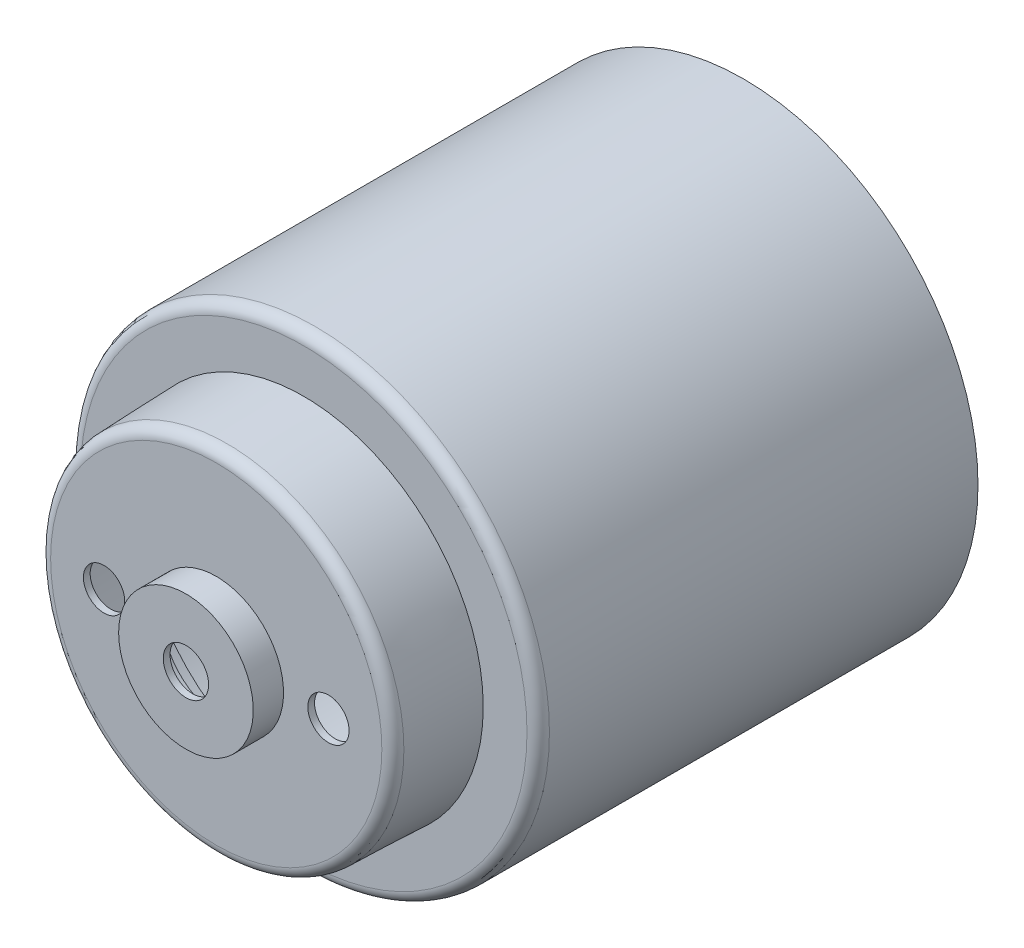
ISO-10303-21;
HEADER;
FILE_DESCRIPTION(('STEP AP214'),'2;1');
FILE_NAME('part.step','',(''),(''),'','','');
FILE_SCHEMA(('AUTOMOTIVE_DESIGN { 1 0 10303 214 1 1 1 1 }'));
ENDSEC;
DATA;
#1=APPLICATION_CONTEXT('core data for automotive mechanical design processes');
#2=APPLICATION_PROTOCOL_DEFINITION('international standard','automotive_design',2000,#1);
#3=PRODUCT_CONTEXT('',#1,'mechanical');
#4=PRODUCT('Part','Part','',(#3));
#5=PRODUCT_RELATED_PRODUCT_CATEGORY('part','',(#4));
#6=PRODUCT_DEFINITION_FORMATION('','',#4);
#7=PRODUCT_DEFINITION_CONTEXT('part definition',#1,'design');
#8=PRODUCT_DEFINITION('design','',#6,#7);
#9=PRODUCT_DEFINITION_SHAPE('','',#8);
#10=(LENGTH_UNIT() NAMED_UNIT(*) SI_UNIT(.MILLI.,.METRE.));
#11=(NAMED_UNIT(*) PLANE_ANGLE_UNIT() SI_UNIT($,.RADIAN.));
#12=(NAMED_UNIT(*) SI_UNIT($,.STERADIAN.) SOLID_ANGLE_UNIT());
#13=UNCERTAINTY_MEASURE_WITH_UNIT(LENGTH_MEASURE(1.E-05),#10,'distance_accuracy_value','');
#14=(GEOMETRIC_REPRESENTATION_CONTEXT(3) GLOBAL_UNCERTAINTY_ASSIGNED_CONTEXT((#13)) GLOBAL_UNIT_ASSIGNED_CONTEXT((#10,
#11,#12)) REPRESENTATION_CONTEXT('',''));
#15=CARTESIAN_POINT('',(0.,0.,0.));
#16=DIRECTION('',(0.,0.,1.));
#17=DIRECTION('',(1.,0.,0.));
#18=AXIS2_PLACEMENT_3D('',#15,#16,#17);
#19=CARTESIAN_POINT('',(0.,0.,23.5));
#20=DIRECTION('',(0.,0.,1.));
#21=DIRECTION('',(1.,0.,0.));
#22=AXIS2_PLACEMENT_3D('',#19,#20,#21);
#23=PLANE('',#22);
#24=CARTESIAN_POINT('',(5.,0.,23.5));
#25=DIRECTION('',(0.,0.,1.));
#26=DIRECTION('',(1.,0.,0.));
#27=AXIS2_PLACEMENT_3D('',#24,#25,#26);
#28=CIRCLE('',#27,0.92);
#29=CARTESIAN_POINT('',(5.92000000000001,0.,23.5));
#30=VERTEX_POINT('',#29);
#31=EDGE_CURVE('E56',#30,#30,#28,.T.);
#32=ORIENTED_EDGE('',*,*,#31,.F.);
#33=EDGE_LOOP('',(#32));
#34=FACE_BOUND('',#33,.T.);
#35=CARTESIAN_POINT('',(-5.,0.,23.5));
#36=DIRECTION('',(0.,0.,1.));
#37=DIRECTION('',(1.,0.,0.));
#38=AXIS2_PLACEMENT_3D('',#35,#36,#37);
#39=CIRCLE('',#38,0.92);
#40=CARTESIAN_POINT('',(-4.08,0.,23.5));
#41=VERTEX_POINT('',#40);
#42=EDGE_CURVE('E55',#41,#41,#39,.T.);
#43=ORIENTED_EDGE('',*,*,#42,.F.);
#44=EDGE_LOOP('',(#43));
#45=FACE_BOUND('',#44,.T.);
#46=CARTESIAN_POINT('',(0.,0.,23.5));
#47=DIRECTION('',(0.,0.,1.));
#48=DIRECTION('',(1.,0.,0.));
#49=AXIS2_PLACEMENT_3D('',#46,#47,#48);
#50=CIRCLE('',#49,7.38096461157865);
#51=CARTESIAN_POINT('',(7.38096461157865,0.,23.5));
#52=VERTEX_POINT('',#51);
#53=EDGE_CURVE('E104',#52,#52,#50,.T.);
#54=ORIENTED_EDGE('',*,*,#53,.T.);
#55=EDGE_LOOP('',(#54));
#56=FACE_BOUND('',#55,.T.);
#57=CARTESIAN_POINT('',(0.,0.,23.5));
#58=DIRECTION('',(0.,0.,1.));
#59=DIRECTION('',(1.,0.,0.));
#60=AXIS2_PLACEMENT_3D('',#57,#58,#59);
#61=CIRCLE('',#60,3.);
#62=CARTESIAN_POINT('',(-3.,0.,23.5));
#63=VERTEX_POINT('',#62);
#64=EDGE_CURVE('E90',#63,#63,#61,.T.);
#65=ORIENTED_EDGE('',*,*,#64,.F.);
#66=EDGE_LOOP('',(#65));
#67=FACE_BOUND('',#66,.T.);
#68=ADVANCED_FACE('F32',(#34,#45,#56,#67),#23,.T.);
#69=CARTESIAN_POINT('',(0.,0.,19.6));
#70=DIRECTION('',(0.,0.,1.));
#71=DIRECTION('',(1.,0.,0.));
#72=AXIS2_PLACEMENT_3D('',#69,#70,#71);
#73=PLANE('',#72);
#74=CARTESIAN_POINT('',(0.,0.,19.6));
#75=DIRECTION('',(0.,0.,1.));
#76=DIRECTION('',(1.,0.,0.));
#77=AXIS2_PLACEMENT_3D('',#74,#75,#76);
#78=CIRCLE('',#77,9.95);
#79=CARTESIAN_POINT('',(9.95,0.,19.6));
#80=VERTEX_POINT('',#79);
#81=EDGE_CURVE('E40',#80,#80,#78,.T.);
#82=ORIENTED_EDGE('',*,*,#81,.T.);
#83=EDGE_LOOP('',(#82));
#84=FACE_BOUND('',#83,.T.);
#85=CARTESIAN_POINT('',(0.,0.,19.6));
#86=DIRECTION('',(0.,0.,1.));
#87=DIRECTION('',(1.,0.,0.));
#88=AXIS2_PLACEMENT_3D('',#85,#86,#87);
#89=CIRCLE('',#88,8.);
#90=CARTESIAN_POINT('',(8.,0.,19.6));
#91=VERTEX_POINT('',#90);
#92=EDGE_CURVE('E98',#91,#91,#89,.T.);
#93=ORIENTED_EDGE('',*,*,#92,.F.);
#94=EDGE_LOOP('',(#93));
#95=FACE_BOUND('',#94,.T.);
#96=ADVANCED_FACE('F121',(#84,#95),#73,.T.);
#97=CARTESIAN_POINT('',(0.,0.,19.6));
#98=DIRECTION('',(0.,0.,-1.));
#99=DIRECTION('',(-1.,0.,0.));
#100=AXIS2_PLACEMENT_3D('',#97,#98,#99);
#101=CYLINDRICAL_SURFACE('',#100,10.45);
#102=CARTESIAN_POINT('',(0.,0.,19.1));
#103=DIRECTION('',(0.,0.,1.));
#104=DIRECTION('',(1.,0.,0.));
#105=AXIS2_PLACEMENT_3D('',#102,#103,#104);
#106=CIRCLE('',#105,10.45);
#107=CARTESIAN_POINT('',(10.45,0.,19.1));
#108=VERTEX_POINT('',#107);
#109=EDGE_CURVE('E10',#108,#108,#106,.F.);
#110=ORIENTED_EDGE('',*,*,#109,.T.);
#111=EDGE_LOOP('',(#110));
#112=FACE_BOUND('',#111,.T.);
#113=CARTESIAN_POINT('',(0.,0.,0.));
#114=DIRECTION('',(0.,0.,1.));
#115=DIRECTION('',(1.,0.,0.));
#116=AXIS2_PLACEMENT_3D('',#113,#114,#115);
#117=CIRCLE('',#116,10.45);
#118=CARTESIAN_POINT('',(10.45,0.,0.));
#119=VERTEX_POINT('',#118);
#120=EDGE_CURVE('E101',#119,#119,#117,.T.);
#121=ORIENTED_EDGE('',*,*,#120,.T.);
#122=EDGE_LOOP('',(#121));
#123=FACE_BOUND('',#122,.T.);
#124=ADVANCED_FACE('F141',(#112,#123),#101,.T.);
#125=CARTESIAN_POINT('',(0.,0.,0.));
#126=DIRECTION('',(0.,0.,1.));
#127=DIRECTION('',(1.,0.,0.));
#128=AXIS2_PLACEMENT_3D('',#125,#126,#127);
#129=PLANE('',#128);
#130=CARTESIAN_POINT('',(0.,0.,0.));
#131=DIRECTION('',(0.,0.,1.));
#132=DIRECTION('',(1.,0.,0.));
#133=AXIS2_PLACEMENT_3D('',#130,#131,#132);
#134=CIRCLE('',#133,10.15);
#135=CARTESIAN_POINT('',(10.15,0.,0.));
#136=VERTEX_POINT('',#135);
#137=EDGE_CURVE('E73',#136,#136,#134,.T.);
#138=ORIENTED_EDGE('',*,*,#137,.T.);
#139=EDGE_LOOP('',(#138));
#140=FACE_BOUND('',#139,.T.);
#141=ORIENTED_EDGE('',*,*,#120,.F.);
#142=EDGE_LOOP('',(#141));
#143=FACE_BOUND('',#142,.T.);
#144=ADVANCED_FACE('F136',(#140,#143),#129,.F.);
#145=CARTESIAN_POINT('',(0.,0.,19.6));
#146=DIRECTION('',(0.,0.,-1.));
#147=DIRECTION('',(1.,0.,0.));
#148=AXIS2_PLACEMENT_3D('',#145,#146,#147);
#149=CONICAL_SURFACE('',#148,8.,0.0349065850398867);
#150=CARTESIAN_POINT('',(0.,0.,23.0174497483512));
#151=DIRECTION('',(0.,0.,-1.));
#152=DIRECTION('',(-1.,0.,0.));
#153=AXIS2_PLACEMENT_3D('',#150,#151,#152);
#154=CIRCLE('',#153,7.8806600250882);
#155=CARTESIAN_POINT('',(-7.88066002508819,0.,23.0174497483512));
#156=VERTEX_POINT('',#155);
#157=EDGE_CURVE('E45',#156,#156,#154,.T.);
#158=ORIENTED_EDGE('',*,*,#157,.T.);
#159=EDGE_LOOP('',(#158));
#160=FACE_BOUND('',#159,.T.);
#161=ORIENTED_EDGE('',*,*,#92,.T.);
#162=EDGE_LOOP('',(#161));
#163=FACE_BOUND('',#162,.T.);
#164=ADVANCED_FACE('F34',(#160,#163),#149,.T.);
#165=CARTESIAN_POINT('',(0.,0.,24.85));
#166=DIRECTION('',(0.,0.,-1.));
#167=DIRECTION('',(-1.,0.,0.));
#168=AXIS2_PLACEMENT_3D('',#165,#166,#167);
#169=CYLINDRICAL_SURFACE('',#168,3.);
#170=CARTESIAN_POINT('',(0.,0.,24.85));
#171=DIRECTION('',(0.,0.,1.));
#172=DIRECTION('',(1.,0.,0.));
#173=AXIS2_PLACEMENT_3D('',#170,#171,#172);
#174=CIRCLE('',#173,3.);
#175=CARTESIAN_POINT('',(-3.,0.,24.85));
#176=VERTEX_POINT('',#175);
#177=EDGE_CURVE('E95',#176,#176,#174,.T.);
#178=CARTESIAN_POINT('',(-3.,0.,24.85));
#179=CARTESIAN_POINT('',(-3.,0.,24.8359375));
#180=CARTESIAN_POINT('',(-3.,0.,24.821875));
#181=CARTESIAN_POINT('',(-3.,0.,24.79375));
#182=CARTESIAN_POINT('',(-3.,0.,24.7796875));
#183=CARTESIAN_POINT('',(-3.,0.,24.7515625));
#184=CARTESIAN_POINT('',(-3.,0.,24.7375));
#185=CARTESIAN_POINT('',(-3.,0.,24.709375));
#186=CARTESIAN_POINT('',(-3.,0.,24.6953125));
#187=CARTESIAN_POINT('',(-3.,0.,24.6671875));
#188=CARTESIAN_POINT('',(-3.,0.,24.653125));
#189=CARTESIAN_POINT('',(-3.,0.,24.625));
#190=CARTESIAN_POINT('',(-3.,0.,24.6109375));
#191=CARTESIAN_POINT('',(-3.,0.,24.5828125));
#192=CARTESIAN_POINT('',(-3.,0.,24.56875));
#193=CARTESIAN_POINT('',(-3.,0.,24.540625));
#194=CARTESIAN_POINT('',(-3.,0.,24.5265625));
#195=CARTESIAN_POINT('',(-3.,0.,24.4984375));
#196=CARTESIAN_POINT('',(-3.,0.,24.484375));
#197=CARTESIAN_POINT('',(-3.,0.,24.45625));
#198=CARTESIAN_POINT('',(-3.,0.,24.4421875));
#199=CARTESIAN_POINT('',(-3.,0.,24.4140625));
#200=CARTESIAN_POINT('',(-3.,0.,24.4));
#201=CARTESIAN_POINT('',(-3.,0.,24.371875));
#202=CARTESIAN_POINT('',(-3.,0.,24.3578125));
#203=CARTESIAN_POINT('',(-3.,0.,24.3296875));
#204=CARTESIAN_POINT('',(-3.,0.,24.315625));
#205=CARTESIAN_POINT('',(-3.,0.,24.2875));
#206=CARTESIAN_POINT('',(-3.,0.,24.2734375));
#207=CARTESIAN_POINT('',(-3.,0.,24.2453125));
#208=CARTESIAN_POINT('',(-3.,0.,24.23125));
#209=CARTESIAN_POINT('',(-3.,0.,24.203125));
#210=CARTESIAN_POINT('',(-3.,0.,24.1890625));
#211=CARTESIAN_POINT('',(-3.,0.,24.1609375));
#212=CARTESIAN_POINT('',(-3.,0.,24.146875));
#213=CARTESIAN_POINT('',(-3.,0.,24.11875));
#214=CARTESIAN_POINT('',(-3.,0.,24.1046875));
#215=CARTESIAN_POINT('',(-3.,0.,24.0765625));
#216=CARTESIAN_POINT('',(-3.,0.,24.0625));
#217=CARTESIAN_POINT('',(-3.,0.,24.034375));
#218=CARTESIAN_POINT('',(-3.,0.,24.0203125));
#219=CARTESIAN_POINT('',(-3.,0.,23.9921875));
#220=CARTESIAN_POINT('',(-3.,0.,23.978125));
#221=CARTESIAN_POINT('',(-3.,0.,23.95));
#222=CARTESIAN_POINT('',(-3.,0.,23.9359375));
#223=CARTESIAN_POINT('',(-3.,0.,23.9078125));
#224=CARTESIAN_POINT('',(-3.,0.,23.89375));
#225=CARTESIAN_POINT('',(-3.,0.,23.865625));
#226=CARTESIAN_POINT('',(-3.,0.,23.8515625));
#227=CARTESIAN_POINT('',(-3.,0.,23.8234375));
#228=CARTESIAN_POINT('',(-3.,0.,23.809375));
#229=CARTESIAN_POINT('',(-3.,0.,23.78125));
#230=CARTESIAN_POINT('',(-3.,0.,23.7671875));
#231=CARTESIAN_POINT('',(-3.,0.,23.7390625));
#232=CARTESIAN_POINT('',(-3.,0.,23.725));
#233=CARTESIAN_POINT('',(-3.,0.,23.696875));
#234=CARTESIAN_POINT('',(-3.,0.,23.6828125));
#235=CARTESIAN_POINT('',(-3.,0.,23.6546875));
#236=CARTESIAN_POINT('',(-3.,0.,23.640625));
#237=CARTESIAN_POINT('',(-3.,0.,23.6125));
#238=CARTESIAN_POINT('',(-3.,0.,23.5984375));
#239=CARTESIAN_POINT('',(-3.,0.,23.5703125));
#240=CARTESIAN_POINT('',(-3.,0.,23.55625));
#241=CARTESIAN_POINT('',(-3.,0.,23.528125));
#242=CARTESIAN_POINT('',(-3.,0.,23.5140625));
#243=CARTESIAN_POINT('',(-3.,0.,23.5));
#244=B_SPLINE_CURVE_WITH_KNOTS('',3,(#178,#179,#180,#181,#182,#183,#184,#185,#186,#187,#188,
#189,#190,#191,#192,#193,#194,#195,#196,#197,#198,#199,#200,#201,#202,#203,#204,#205,#206,#207,
#208,#209,#210,#211,#212,#213,#214,#215,#216,#217,#218,#219,#220,#221,#222,#223,#224,#225,#226,
#227,#228,#229,#230,#231,#232,#233,#234,#235,#236,#237,#238,#239,#240,#241,#242,#243),
.UNSPECIFIED.,.F.,.F.,(4,2,2,2,2,2,2,2,2,2,2,2,2,2,2,2,2,2,2,2,2,2,2,2,2,2,2,2,2,2,2,2,4),(0.,
0.0421875000000023,0.0843750000000011,0.1265625,0.168750000000002,0.210937500000001,0.253125,
0.295312500000002,0.337500000000001,0.3796875,0.421875000000002,0.464062500000001,0.50625,
0.548437500000002,0.590625000000001,0.6328125,0.674999999999998,0.717187500000001,0.759375,
0.801562499999998,0.843750000000001,0.8859375,0.928124999999998,0.970312500000001,1.0125,
1.0546875,1.096875,1.1390625,1.18125,1.2234375,1.265625,1.3078125,1.35),.UNSPECIFIED.);
#245=EDGE_CURVE('BSEAM126',#176,#63,#244,.T.);
#246=ORIENTED_EDGE('',*,*,#177,.F.);
#247=ORIENTED_EDGE('',*,*,#64,.T.);
#248=ORIENTED_EDGE('',*,*,#245,.T.);
#249=ORIENTED_EDGE('',*,*,#245,.F.);
#250=EDGE_LOOP('',(#246,#248,#247,#249));
#251=FACE_BOUND('',#250,.T.);
#252=ADVANCED_FACE('F126',(#251),#169,.T.);
#253=CARTESIAN_POINT('',(0.,0.,24.85));
#254=DIRECTION('',(0.,0.,1.));
#255=DIRECTION('',(1.,0.,0.));
#256=AXIS2_PLACEMENT_3D('',#253,#254,#255);
#257=PLANE('',#256);
#258=CARTESIAN_POINT('',(0.,0.,24.85));
#259=DIRECTION('',(0.,0.,1.));
#260=DIRECTION('',(1.,0.,0.));
#261=AXIS2_PLACEMENT_3D('',#258,#259,#260);
#262=CIRCLE('',#261,1.01);
#263=CARTESIAN_POINT('',(1.01,0.,24.85));
#264=VERTEX_POINT('',#263);
#265=EDGE_CURVE('E52',#264,#264,#262,.T.);
#266=ORIENTED_EDGE('',*,*,#265,.F.);
#267=EDGE_LOOP('',(#266));
#268=FACE_BOUND('',#267,.T.);
#269=ORIENTED_EDGE('',*,*,#177,.T.);
#270=EDGE_LOOP('',(#269));
#271=FACE_BOUND('',#270,.T.);
#272=ADVANCED_FACE('F115',(#268,#271),#257,.T.);
#273=CARTESIAN_POINT('',(0.,0.,23.));
#274=DIRECTION('',(0.,0.,1.));
#275=DIRECTION('',(1.,0.,0.));
#276=AXIS2_PLACEMENT_3D('',#273,#274,#275);
#277=TOROIDAL_SURFACE('',#276,7.38096461157865,0.5);
#278=ORIENTED_EDGE('',*,*,#157,.F.);
#279=EDGE_LOOP('',(#278));
#280=FACE_BOUND('',#279,.T.);
#281=ORIENTED_EDGE('',*,*,#53,.F.);
#282=EDGE_LOOP('',(#281));
#283=FACE_BOUND('',#282,.T.);
#284=ADVANCED_FACE('F111',(#280,#283),#277,.T.);
#285=CARTESIAN_POINT('',(0.,0.,19.1));
#286=DIRECTION('',(0.,0.,1.));
#287=DIRECTION('',(1.,0.,0.));
#288=AXIS2_PLACEMENT_3D('',#285,#286,#287);
#289=TOROIDAL_SURFACE('',#288,9.95,0.5);
#290=ORIENTED_EDGE('',*,*,#109,.F.);
#291=EDGE_LOOP('',(#290));
#292=FACE_BOUND('',#291,.T.);
#293=ORIENTED_EDGE('',*,*,#81,.F.);
#294=EDGE_LOOP('',(#293));
#295=FACE_BOUND('',#294,.T.);
#296=ADVANCED_FACE('F114',(#292,#295),#289,.T.);
#297=CARTESIAN_POINT('',(0.,0.,23.2));
#298=DIRECTION('',(0.,0.,1.));
#299=DIRECTION('',(1.,0.,0.));
#300=AXIS2_PLACEMENT_3D('',#297,#298,#299);
#301=PLANE('',#300);
#302=CARTESIAN_POINT('',(5.,0.,23.2));
#303=DIRECTION('',(0.,0.,1.));
#304=DIRECTION('',(1.,0.,0.));
#305=AXIS2_PLACEMENT_3D('',#302,#303,#304);
#306=CIRCLE('',#305,0.92);
#307=CARTESIAN_POINT('',(5.92000000000001,0.,23.2));
#308=VERTEX_POINT('',#307);
#309=EDGE_CURVE('E36',#308,#308,#306,.T.);
#310=ORIENTED_EDGE('',*,*,#309,.T.);
#311=EDGE_LOOP('',(#310));
#312=FACE_BOUND('',#311,.T.);
#313=CARTESIAN_POINT('',(-5.,0.,23.2));
#314=DIRECTION('',(0.,0.,1.));
#315=DIRECTION('',(1.,0.,0.));
#316=AXIS2_PLACEMENT_3D('',#313,#314,#315);
#317=CIRCLE('',#316,0.92);
#318=CARTESIAN_POINT('',(-4.08,0.,23.2));
#319=VERTEX_POINT('',#318);
#320=EDGE_CURVE('E53',#319,#319,#317,.T.);
#321=ORIENTED_EDGE('',*,*,#320,.T.);
#322=EDGE_LOOP('',(#321));
#323=FACE_BOUND('',#322,.T.);
#324=CARTESIAN_POINT('',(0.,0.,23.2));
#325=DIRECTION('',(0.,0.,1.));
#326=DIRECTION('',(1.,0.,0.));
#327=AXIS2_PLACEMENT_3D('',#324,#325,#326);
#328=CIRCLE('',#327,7.38096461157865);
#329=CARTESIAN_POINT('',(7.38096461157865,0.,23.2));
#330=VERTEX_POINT('',#329);
#331=EDGE_CURVE('E69',#330,#330,#328,.T.);
#332=ORIENTED_EDGE('',*,*,#331,.F.);
#333=EDGE_LOOP('',(#332));
#334=FACE_BOUND('',#333,.T.);
#335=CARTESIAN_POINT('',(0.,0.,23.2));
#336=DIRECTION('',(0.,0.,1.));
#337=DIRECTION('',(1.,0.,0.));
#338=AXIS2_PLACEMENT_3D('',#335,#336,#337);
#339=CIRCLE('',#338,2.7);
#340=CARTESIAN_POINT('',(-2.7,0.,23.2));
#341=VERTEX_POINT('',#340);
#342=EDGE_CURVE('E51',#341,#341,#339,.T.);
#343=ORIENTED_EDGE('',*,*,#342,.T.);
#344=EDGE_LOOP('',(#343));
#345=FACE_BOUND('',#344,.T.);
#346=ADVANCED_FACE('F184',(#312,#323,#334,#345),#301,.F.);
#347=CARTESIAN_POINT('',(0.,0.,19.3));
#348=DIRECTION('',(0.,0.,1.));
#349=DIRECTION('',(1.,0.,0.));
#350=AXIS2_PLACEMENT_3D('',#347,#348,#349);
#351=PLANE('',#350);
#352=CARTESIAN_POINT('',(0.,0.,19.3));
#353=DIRECTION('',(0.,0.,1.));
#354=DIRECTION('',(1.,0.,0.));
#355=AXIS2_PLACEMENT_3D('',#352,#353,#354);
#356=CIRCLE('',#355,9.95);
#357=CARTESIAN_POINT('',(9.95,0.,19.3));
#358=VERTEX_POINT('',#357);
#359=EDGE_CURVE('E82',#358,#358,#356,.T.);
#360=ORIENTED_EDGE('',*,*,#359,.F.);
#361=EDGE_LOOP('',(#360));
#362=FACE_BOUND('',#361,.T.);
#363=CARTESIAN_POINT('',(0.,0.,19.3));
#364=DIRECTION('',(0.,0.,1.));
#365=DIRECTION('',(1.,0.,0.));
#366=AXIS2_PLACEMENT_3D('',#363,#364,#365);
#367=CIRCLE('',#366,7.71029336755788);
#368=CARTESIAN_POINT('',(7.71029336755788,0.,19.3));
#369=VERTEX_POINT('',#368);
#370=EDGE_CURVE('E79',#369,#369,#367,.T.);
#371=ORIENTED_EDGE('',*,*,#370,.T.);
#372=EDGE_LOOP('',(#371));
#373=FACE_BOUND('',#372,.T.);
#374=ADVANCED_FACE('F192',(#362,#373),#351,.F.);
#375=CARTESIAN_POINT('',(0.,0.,19.6));
#376=DIRECTION('',(0.,0.,-1.));
#377=DIRECTION('',(-1.,0.,0.));
#378=AXIS2_PLACEMENT_3D('',#375,#376,#377);
#379=CYLINDRICAL_SURFACE('',#378,10.15);
#380=CARTESIAN_POINT('',(0.,0.,19.1));
#381=DIRECTION('',(0.,0.,-1.));
#382=DIRECTION('',(-1.,0.,0.));
#383=AXIS2_PLACEMENT_3D('',#380,#381,#382);
#384=CIRCLE('',#383,10.15);
#385=CARTESIAN_POINT('',(-10.15,0.,19.1));
#386=VERTEX_POINT('',#385);
#387=EDGE_CURVE('E87',#386,#386,#384,.T.);
#388=ORIENTED_EDGE('',*,*,#387,.F.);
#389=EDGE_LOOP('',(#388));
#390=FACE_BOUND('',#389,.T.);
#391=ORIENTED_EDGE('',*,*,#137,.F.);
#392=EDGE_LOOP('',(#391));
#393=FACE_BOUND('',#392,.T.);
#394=ADVANCED_FACE('F200',(#390,#393),#379,.F.);
#395=CARTESIAN_POINT('',(0.,0.,19.5895301509893));
#396=DIRECTION('',(0.,0.,-1.));
#397=DIRECTION('',(1.,0.,0.));
#398=AXIS2_PLACEMENT_3D('',#395,#396,#397);
#399=CONICAL_SURFACE('',#398,7.70018275189427,0.0349065850398867);
#400=CARTESIAN_POINT('',(0.,0.,23.0069798993405));
#401=DIRECTION('',(0.,0.,-1.));
#402=DIRECTION('',(-1.,0.,0.));
#403=AXIS2_PLACEMENT_3D('',#400,#401,#402);
#404=CIRCLE('',#403,7.58084277698247);
#405=CARTESIAN_POINT('',(-7.58084277698247,0.,23.0069798993405));
#406=VERTEX_POINT('',#405);
#407=EDGE_CURVE('E72',#406,#406,#404,.T.);
#408=ORIENTED_EDGE('',*,*,#407,.F.);
#409=EDGE_LOOP('',(#408));
#410=FACE_BOUND('',#409,.T.);
#411=ORIENTED_EDGE('',*,*,#370,.F.);
#412=EDGE_LOOP('',(#411));
#413=FACE_BOUND('',#412,.T.);
#414=ADVANCED_FACE('F208',(#410,#413),#399,.F.);
#415=CARTESIAN_POINT('',(0.,0.,24.85));
#416=DIRECTION('',(0.,0.,-1.));
#417=DIRECTION('',(-1.,0.,0.));
#418=AXIS2_PLACEMENT_3D('',#415,#416,#417);
#419=CYLINDRICAL_SURFACE('',#418,2.7);
#420=CARTESIAN_POINT('',(0.,0.,24.55));
#421=DIRECTION('',(0.,0.,1.));
#422=DIRECTION('',(1.,0.,0.));
#423=AXIS2_PLACEMENT_3D('',#420,#421,#422);
#424=CIRCLE('',#423,2.7);
#425=CARTESIAN_POINT('',(-2.7,0.,24.55));
#426=VERTEX_POINT('',#425);
#427=EDGE_CURVE('E76',#426,#426,#424,.T.);
#428=CARTESIAN_POINT('',(-2.7,0.,24.55));
#429=CARTESIAN_POINT('',(-2.7,0.,24.5359375));
#430=CARTESIAN_POINT('',(-2.7,0.,24.521875));
#431=CARTESIAN_POINT('',(-2.7,0.,24.49375));
#432=CARTESIAN_POINT('',(-2.7,0.,24.4796875));
#433=CARTESIAN_POINT('',(-2.7,0.,24.4515625));
#434=CARTESIAN_POINT('',(-2.7,0.,24.4375));
#435=CARTESIAN_POINT('',(-2.7,0.,24.409375));
#436=CARTESIAN_POINT('',(-2.7,0.,24.3953125));
#437=CARTESIAN_POINT('',(-2.7,0.,24.3671875));
#438=CARTESIAN_POINT('',(-2.7,0.,24.353125));
#439=CARTESIAN_POINT('',(-2.7,0.,24.325));
#440=CARTESIAN_POINT('',(-2.7,0.,24.3109375));
#441=CARTESIAN_POINT('',(-2.7,0.,24.2828125));
#442=CARTESIAN_POINT('',(-2.7,0.,24.26875));
#443=CARTESIAN_POINT('',(-2.7,0.,24.240625));
#444=CARTESIAN_POINT('',(-2.7,0.,24.2265625));
#445=CARTESIAN_POINT('',(-2.7,0.,24.1984375));
#446=CARTESIAN_POINT('',(-2.7,0.,24.184375));
#447=CARTESIAN_POINT('',(-2.7,0.,24.15625));
#448=CARTESIAN_POINT('',(-2.7,0.,24.1421875));
#449=CARTESIAN_POINT('',(-2.7,0.,24.1140625));
#450=CARTESIAN_POINT('',(-2.7,0.,24.1));
#451=CARTESIAN_POINT('',(-2.7,0.,24.071875));
#452=CARTESIAN_POINT('',(-2.7,0.,24.0578125));
#453=CARTESIAN_POINT('',(-2.7,0.,24.0296875));
#454=CARTESIAN_POINT('',(-2.7,0.,24.015625));
#455=CARTESIAN_POINT('',(-2.7,0.,23.9875));
#456=CARTESIAN_POINT('',(-2.7,0.,23.9734375));
#457=CARTESIAN_POINT('',(-2.7,0.,23.9453125));
#458=CARTESIAN_POINT('',(-2.7,0.,23.93125));
#459=CARTESIAN_POINT('',(-2.7,0.,23.903125));
#460=CARTESIAN_POINT('',(-2.7,0.,23.8890625));
#461=CARTESIAN_POINT('',(-2.7,0.,23.8609375));
#462=CARTESIAN_POINT('',(-2.7,0.,23.846875));
#463=CARTESIAN_POINT('',(-2.7,0.,23.81875));
#464=CARTESIAN_POINT('',(-2.7,0.,23.8046875));
#465=CARTESIAN_POINT('',(-2.7,0.,23.7765625));
#466=CARTESIAN_POINT('',(-2.7,0.,23.7625));
#467=CARTESIAN_POINT('',(-2.7,0.,23.734375));
#468=CARTESIAN_POINT('',(-2.7,0.,23.7203125));
#469=CARTESIAN_POINT('',(-2.7,0.,23.6921875));
#470=CARTESIAN_POINT('',(-2.7,0.,23.678125));
#471=CARTESIAN_POINT('',(-2.7,0.,23.65));
#472=CARTESIAN_POINT('',(-2.7,0.,23.6359375));
#473=CARTESIAN_POINT('',(-2.7,0.,23.6078125));
#474=CARTESIAN_POINT('',(-2.7,0.,23.59375));
#475=CARTESIAN_POINT('',(-2.7,0.,23.565625));
#476=CARTESIAN_POINT('',(-2.7,0.,23.5515625));
#477=CARTESIAN_POINT('',(-2.7,0.,23.5234375));
#478=CARTESIAN_POINT('',(-2.7,0.,23.509375));
#479=CARTESIAN_POINT('',(-2.7,0.,23.48125));
#480=CARTESIAN_POINT('',(-2.7,0.,23.4671875));
#481=CARTESIAN_POINT('',(-2.7,0.,23.4390625));
#482=CARTESIAN_POINT('',(-2.7,0.,23.425));
#483=CARTESIAN_POINT('',(-2.7,0.,23.396875));
#484=CARTESIAN_POINT('',(-2.7,0.,23.3828125));
#485=CARTESIAN_POINT('',(-2.7,0.,23.3546875));
#486=CARTESIAN_POINT('',(-2.7,0.,23.340625));
#487=CARTESIAN_POINT('',(-2.7,0.,23.3125));
#488=CARTESIAN_POINT('',(-2.7,0.,23.2984375));
#489=CARTESIAN_POINT('',(-2.7,0.,23.2703125));
#490=CARTESIAN_POINT('',(-2.7,0.,23.25625));
#491=CARTESIAN_POINT('',(-2.7,0.,23.228125));
#492=CARTESIAN_POINT('',(-2.7,0.,23.2140625));
#493=CARTESIAN_POINT('',(-2.7,0.,23.2));
#494=B_SPLINE_CURVE_WITH_KNOTS('',3,(#428,#429,#430,#431,#432,#433,#434,#435,#436,#437,#438,
#439,#440,#441,#442,#443,#444,#445,#446,#447,#448,#449,#450,#451,#452,#453,#454,#455,#456,#457,
#458,#459,#460,#461,#462,#463,#464,#465,#466,#467,#468,#469,#470,#471,#472,#473,#474,#475,#476,
#477,#478,#479,#480,#481,#482,#483,#484,#485,#486,#487,#488,#489,#490,#491,#492,#493),
.UNSPECIFIED.,.F.,.F.,(4,2,2,2,2,2,2,2,2,2,2,2,2,2,2,2,2,2,2,2,2,2,2,2,2,2,2,2,2,2,2,2,4),(0.,
0.0421875000000023,0.0843750000000011,0.1265625,0.168750000000002,0.210937500000001,0.253125,
0.295312500000002,0.337500000000001,0.3796875,0.421875000000002,0.464062500000001,0.50625,
0.548437500000002,0.590625000000001,0.6328125,0.674999999999998,0.717187500000001,0.759375,
0.801562499999998,0.843750000000001,0.8859375,0.928124999999998,0.970312500000001,1.0125,
1.0546875,1.096875,1.1390625,1.18125,1.2234375,1.265625,1.3078125,1.35),.UNSPECIFIED.);
#495=EDGE_CURVE('BSEAM216',#426,#341,#494,.T.);
#496=ORIENTED_EDGE('',*,*,#427,.T.);
#497=ORIENTED_EDGE('',*,*,#342,.F.);
#498=ORIENTED_EDGE('',*,*,#495,.T.);
#499=ORIENTED_EDGE('',*,*,#495,.F.);
#500=EDGE_LOOP('',(#496,#498,#497,#499));
#501=FACE_BOUND('',#500,.T.);
#502=ADVANCED_FACE('F216',(#501),#419,.F.);
#503=CARTESIAN_POINT('',(0.,0.,24.55));
#504=DIRECTION('',(0.,0.,1.));
#505=DIRECTION('',(1.,0.,0.));
#506=AXIS2_PLACEMENT_3D('',#503,#504,#505);
#507=PLANE('',#506);
#508=CARTESIAN_POINT('',(0.,0.,24.55));
#509=DIRECTION('',(0.,0.,1.));
#510=DIRECTION('',(1.,0.,0.));
#511=AXIS2_PLACEMENT_3D('',#508,#509,#510);
#512=CIRCLE('',#511,1.01);
#513=CARTESIAN_POINT('',(1.01,0.,24.55));
#514=VERTEX_POINT('',#513);
#515=EDGE_CURVE('E49',#514,#514,#512,.T.);
#516=ORIENTED_EDGE('',*,*,#515,.T.);
#517=EDGE_LOOP('',(#516));
#518=FACE_BOUND('',#517,.T.);
#519=ORIENTED_EDGE('',*,*,#427,.F.);
#520=EDGE_LOOP('',(#519));
#521=FACE_BOUND('',#520,.T.);
#522=ADVANCED_FACE('F224',(#518,#521),#507,.F.);
#523=CARTESIAN_POINT('',(0.,0.,23.));
#524=DIRECTION('',(0.,0.,1.));
#525=DIRECTION('',(1.,0.,0.));
#526=AXIS2_PLACEMENT_3D('',#523,#524,#525);
#527=TOROIDAL_SURFACE('',#526,7.38096461157865,0.2);
#528=ORIENTED_EDGE('',*,*,#407,.T.);
#529=EDGE_LOOP('',(#528));
#530=FACE_BOUND('',#529,.T.);
#531=ORIENTED_EDGE('',*,*,#331,.T.);
#532=EDGE_LOOP('',(#531));
#533=FACE_BOUND('',#532,.T.);
#534=ADVANCED_FACE('F232',(#530,#533),#527,.F.);
#535=CARTESIAN_POINT('',(0.,0.,19.1));
#536=DIRECTION('',(0.,0.,1.));
#537=DIRECTION('',(1.,0.,0.));
#538=AXIS2_PLACEMENT_3D('',#535,#536,#537);
#539=TOROIDAL_SURFACE('',#538,9.95,0.2);
#540=ORIENTED_EDGE('',*,*,#387,.T.);
#541=EDGE_LOOP('',(#540));
#542=FACE_BOUND('',#541,.T.);
#543=ORIENTED_EDGE('',*,*,#359,.T.);
#544=EDGE_LOOP('',(#543));
#545=FACE_BOUND('',#544,.T.);
#546=ADVANCED_FACE('F240',(#542,#545),#539,.F.);
#547=CARTESIAN_POINT('',(0.,0.,0.));
#548=DIRECTION('',(0.,0.,1.));
#549=DIRECTION('',(1.,0.,0.));
#550=AXIS2_PLACEMENT_3D('',#547,#548,#549);
#551=CYLINDRICAL_SURFACE('',#550,1.01);
#552=CARTESIAN_POINT('',(1.01,0.,24.85));
#553=CARTESIAN_POINT('',(1.01,0.,24.846875));
#554=CARTESIAN_POINT('',(1.01,0.,24.84375));
#555=CARTESIAN_POINT('',(1.01,0.,24.8375));
#556=CARTESIAN_POINT('',(1.01,0.,24.834375));
#557=CARTESIAN_POINT('',(1.01,0.,24.828125));
#558=CARTESIAN_POINT('',(1.01,0.,24.825));
#559=CARTESIAN_POINT('',(1.01,0.,24.81875));
#560=CARTESIAN_POINT('',(1.01,0.,24.815625));
#561=CARTESIAN_POINT('',(1.01,0.,24.809375));
#562=CARTESIAN_POINT('',(1.01,0.,24.80625));
#563=CARTESIAN_POINT('',(1.01,0.,24.8));
#564=CARTESIAN_POINT('',(1.01,0.,24.796875));
#565=CARTESIAN_POINT('',(1.01,0.,24.790625));
#566=CARTESIAN_POINT('',(1.01,0.,24.7875));
#567=CARTESIAN_POINT('',(1.01,0.,24.78125));
#568=CARTESIAN_POINT('',(1.01,0.,24.778125));
#569=CARTESIAN_POINT('',(1.01,0.,24.771875));
#570=CARTESIAN_POINT('',(1.01,0.,24.76875));
#571=CARTESIAN_POINT('',(1.01,0.,24.7625));
#572=CARTESIAN_POINT('',(1.01,0.,24.759375));
#573=CARTESIAN_POINT('',(1.01,0.,24.753125));
#574=CARTESIAN_POINT('',(1.01,0.,24.75));
#575=CARTESIAN_POINT('',(1.01,0.,24.74375));
#576=CARTESIAN_POINT('',(1.01,0.,24.740625));
#577=CARTESIAN_POINT('',(1.01,0.,24.734375));
#578=CARTESIAN_POINT('',(1.01,0.,24.73125));
#579=CARTESIAN_POINT('',(1.01,0.,24.725));
#580=CARTESIAN_POINT('',(1.01,0.,24.721875));
#581=CARTESIAN_POINT('',(1.01,0.,24.715625));
#582=CARTESIAN_POINT('',(1.01,0.,24.7125));
#583=CARTESIAN_POINT('',(1.01,0.,24.70625));
#584=CARTESIAN_POINT('',(1.01,0.,24.703125));
#585=CARTESIAN_POINT('',(1.01,0.,24.696875));
#586=CARTESIAN_POINT('',(1.01,0.,24.69375));
#587=CARTESIAN_POINT('',(1.01,0.,24.6875));
#588=CARTESIAN_POINT('',(1.01,0.,24.684375));
#589=CARTESIAN_POINT('',(1.01,0.,24.678125));
#590=CARTESIAN_POINT('',(1.01,0.,24.675));
#591=CARTESIAN_POINT('',(1.01,0.,24.66875));
#592=CARTESIAN_POINT('',(1.01,0.,24.665625));
#593=CARTESIAN_POINT('',(1.01,0.,24.659375));
#594=CARTESIAN_POINT('',(1.01,0.,24.65625));
#595=CARTESIAN_POINT('',(1.01,0.,24.65));
#596=CARTESIAN_POINT('',(1.01,0.,24.646875));
#597=CARTESIAN_POINT('',(1.01,0.,24.640625));
#598=CARTESIAN_POINT('',(1.01,0.,24.6375));
#599=CARTESIAN_POINT('',(1.01,0.,24.63125));
#600=CARTESIAN_POINT('',(1.01,0.,24.628125));
#601=CARTESIAN_POINT('',(1.01,0.,24.621875));
#602=CARTESIAN_POINT('',(1.01,0.,24.61875));
#603=CARTESIAN_POINT('',(1.01,0.,24.6125));
#604=CARTESIAN_POINT('',(1.01,0.,24.609375));
#605=CARTESIAN_POINT('',(1.01,0.,24.603125));
#606=CARTESIAN_POINT('',(1.01,0.,24.6));
#607=CARTESIAN_POINT('',(1.01,0.,24.59375));
#608=CARTESIAN_POINT('',(1.01,0.,24.590625));
#609=CARTESIAN_POINT('',(1.01,0.,24.584375));
#610=CARTESIAN_POINT('',(1.01,0.,24.58125));
#611=CARTESIAN_POINT('',(1.01,0.,24.575));
#612=CARTESIAN_POINT('',(1.01,0.,24.571875));
#613=CARTESIAN_POINT('',(1.01,0.,24.565625));
#614=CARTESIAN_POINT('',(1.01,0.,24.5625));
#615=CARTESIAN_POINT('',(1.01,0.,24.55625));
#616=CARTESIAN_POINT('',(1.01,0.,24.553125));
#617=CARTESIAN_POINT('',(1.01,0.,24.55));
#618=B_SPLINE_CURVE_WITH_KNOTS('',3,(#552,#553,#554,#555,#556,#557,#558,#559,#560,#561,#562,
#563,#564,#565,#566,#567,#568,#569,#570,#571,#572,#573,#574,#575,#576,#577,#578,#579,#580,#581,
#582,#583,#584,#585,#586,#587,#588,#589,#590,#591,#592,#593,#594,#595,#596,#597,#598,#599,#600,
#601,#602,#603,#604,#605,#606,#607,#608,#609,#610,#611,#612,#613,#614,#615,#616,#617),
.UNSPECIFIED.,.F.,.F.,(4,2,2,2,2,2,2,2,2,2,2,2,2,2,2,2,2,2,2,2,2,2,2,2,2,2,2,2,2,2,2,2,4),(0.,
0.00937499999999897,0.0187500000000049,0.0281250000000038,0.0375000000000028,0.0468750000000018,
0.0562500000000007,0.0656249999999997,0.0749999999999987,0.0843750000000046,0.0937500000000036,
0.103125000000003,0.112500000000001,0.121875,0.131249999999999,0.140625000000005,
0.150000000000004,0.159375000000003,0.168750000000002,0.178125000000001,0.1875,
0.196875000000006,0.206250000000005,0.215625000000004,0.225000000000003,0.234375000000002,
0.243750000000001,0.253125,0.262500000000006,0.271875000000005,0.281250000000004,
0.290625000000003,0.300000000000002),.UNSPECIFIED.);
#619=EDGE_CURVE('BSEAM248',#264,#514,#618,.T.);
#620=ORIENTED_EDGE('',*,*,#265,.T.);
#621=ORIENTED_EDGE('',*,*,#515,.F.);
#622=ORIENTED_EDGE('',*,*,#619,.T.);
#623=ORIENTED_EDGE('',*,*,#619,.F.);
#624=EDGE_LOOP('',(#620,#622,#621,#623));
#625=FACE_BOUND('',#624,.T.);
#626=ADVANCED_FACE('F248',(#625),#551,.F.);
#627=CARTESIAN_POINT('',(-5.,0.,0.));
#628=DIRECTION('',(0.,0.,1.));
#629=DIRECTION('',(1.,0.,0.));
#630=AXIS2_PLACEMENT_3D('',#627,#628,#629);
#631=CYLINDRICAL_SURFACE('',#630,0.92);
#632=CARTESIAN_POINT('',(-4.08,0.,23.5));
#633=CARTESIAN_POINT('',(-4.08,0.,23.496875));
#634=CARTESIAN_POINT('',(-4.08,0.,23.49375));
#635=CARTESIAN_POINT('',(-4.08,0.,23.4875));
#636=CARTESIAN_POINT('',(-4.08,0.,23.484375));
#637=CARTESIAN_POINT('',(-4.08,0.,23.478125));
#638=CARTESIAN_POINT('',(-4.08,0.,23.475));
#639=CARTESIAN_POINT('',(-4.08,0.,23.46875));
#640=CARTESIAN_POINT('',(-4.08,0.,23.465625));
#641=CARTESIAN_POINT('',(-4.08,0.,23.459375));
#642=CARTESIAN_POINT('',(-4.08,0.,23.45625));
#643=CARTESIAN_POINT('',(-4.08,0.,23.45));
#644=CARTESIAN_POINT('',(-4.08,0.,23.446875));
#645=CARTESIAN_POINT('',(-4.08,0.,23.440625));
#646=CARTESIAN_POINT('',(-4.08,0.,23.4375));
#647=CARTESIAN_POINT('',(-4.08,0.,23.43125));
#648=CARTESIAN_POINT('',(-4.08,0.,23.428125));
#649=CARTESIAN_POINT('',(-4.08,0.,23.421875));
#650=CARTESIAN_POINT('',(-4.08,0.,23.41875));
#651=CARTESIAN_POINT('',(-4.08,0.,23.4125));
#652=CARTESIAN_POINT('',(-4.08,0.,23.409375));
#653=CARTESIAN_POINT('',(-4.08,0.,23.403125));
#654=CARTESIAN_POINT('',(-4.08,0.,23.4));
#655=CARTESIAN_POINT('',(-4.08,0.,23.39375));
#656=CARTESIAN_POINT('',(-4.08,0.,23.390625));
#657=CARTESIAN_POINT('',(-4.08,0.,23.384375));
#658=CARTESIAN_POINT('',(-4.08,0.,23.38125));
#659=CARTESIAN_POINT('',(-4.08,0.,23.375));
#660=CARTESIAN_POINT('',(-4.08,0.,23.371875));
#661=CARTESIAN_POINT('',(-4.08,0.,23.365625));
#662=CARTESIAN_POINT('',(-4.08,0.,23.3625));
#663=CARTESIAN_POINT('',(-4.08,0.,23.35625));
#664=CARTESIAN_POINT('',(-4.08,0.,23.353125));
#665=CARTESIAN_POINT('',(-4.08,0.,23.346875));
#666=CARTESIAN_POINT('',(-4.08,0.,23.34375));
#667=CARTESIAN_POINT('',(-4.08,0.,23.3375));
#668=CARTESIAN_POINT('',(-4.08,0.,23.334375));
#669=CARTESIAN_POINT('',(-4.08,0.,23.328125));
#670=CARTESIAN_POINT('',(-4.08,0.,23.325));
#671=CARTESIAN_POINT('',(-4.08,0.,23.31875));
#672=CARTESIAN_POINT('',(-4.08,0.,23.315625));
#673=CARTESIAN_POINT('',(-4.08,0.,23.309375));
#674=CARTESIAN_POINT('',(-4.08,0.,23.30625));
#675=CARTESIAN_POINT('',(-4.08,0.,23.3));
#676=CARTESIAN_POINT('',(-4.08,0.,23.296875));
#677=CARTESIAN_POINT('',(-4.08,0.,23.290625));
#678=CARTESIAN_POINT('',(-4.08,0.,23.2875));
#679=CARTESIAN_POINT('',(-4.08,0.,23.28125));
#680=CARTESIAN_POINT('',(-4.08,0.,23.278125));
#681=CARTESIAN_POINT('',(-4.08,0.,23.271875));
#682=CARTESIAN_POINT('',(-4.08,0.,23.26875));
#683=CARTESIAN_POINT('',(-4.08,0.,23.2625));
#684=CARTESIAN_POINT('',(-4.08,0.,23.259375));
#685=CARTESIAN_POINT('',(-4.08,0.,23.253125));
#686=CARTESIAN_POINT('',(-4.08,0.,23.25));
#687=CARTESIAN_POINT('',(-4.08,0.,23.24375));
#688=CARTESIAN_POINT('',(-4.08,0.,23.240625));
#689=CARTESIAN_POINT('',(-4.08,0.,23.234375));
#690=CARTESIAN_POINT('',(-4.08,0.,23.23125));
#691=CARTESIAN_POINT('',(-4.08,0.,23.225));
#692=CARTESIAN_POINT('',(-4.08,0.,23.221875));
#693=CARTESIAN_POINT('',(-4.08,0.,23.215625));
#694=CARTESIAN_POINT('',(-4.08,0.,23.2125));
#695=CARTESIAN_POINT('',(-4.08,0.,23.20625));
#696=CARTESIAN_POINT('',(-4.08,0.,23.203125));
#697=CARTESIAN_POINT('',(-4.08,0.,23.2));
#698=B_SPLINE_CURVE_WITH_KNOTS('',3,(#632,#633,#634,#635,#636,#637,#638,#639,#640,#641,#642,
#643,#644,#645,#646,#647,#648,#649,#650,#651,#652,#653,#654,#655,#656,#657,#658,#659,#660,#661,
#662,#663,#664,#665,#666,#667,#668,#669,#670,#671,#672,#673,#674,#675,#676,#677,#678,#679,#680,
#681,#682,#683,#684,#685,#686,#687,#688,#689,#690,#691,#692,#693,#694,#695,#696,#697),
.UNSPECIFIED.,.F.,.F.,(4,2,2,2,2,2,2,2,2,2,2,2,2,2,2,2,2,2,2,2,2,2,2,2,2,2,2,2,2,2,2,2,4),(0.,
0.00937499999999897,0.0187500000000014,0.0281250000000004,0.0374999999999993,0.0468750000000018,
0.0562500000000007,0.0656249999999997,0.0749999999999987,0.0843750000000011,0.0937500000000001,
0.103124999999999,0.112500000000001,0.121875,0.131249999999999,0.140625000000002,
0.150000000000001,0.159375,0.168750000000002,0.178125000000001,0.1875,0.196875000000003,
0.206250000000002,0.215625000000001,0.225000000000003,0.234375000000002,0.243750000000001,
0.253125,0.262500000000002,0.271875000000001,0.28125,0.290625000000003,0.300000000000002),.UNSPECIFIED.);
#699=EDGE_CURVE('BSEAM256',#41,#319,#698,.T.);
#700=ORIENTED_EDGE('',*,*,#42,.T.);
#701=ORIENTED_EDGE('',*,*,#320,.F.);
#702=ORIENTED_EDGE('',*,*,#699,.T.);
#703=ORIENTED_EDGE('',*,*,#699,.F.);
#704=EDGE_LOOP('',(#700,#702,#701,#703));
#705=FACE_BOUND('',#704,.T.);
#706=ADVANCED_FACE('F256',(#705),#631,.F.);
#707=CARTESIAN_POINT('',(5.00000000000001,0.,0.));
#708=DIRECTION('',(0.,0.,1.));
#709=DIRECTION('',(1.,0.,0.));
#710=AXIS2_PLACEMENT_3D('',#707,#708,#709);
#711=CYLINDRICAL_SURFACE('',#710,0.92);
#712=CARTESIAN_POINT('',(5.92000000000001,0.,23.5));
#713=CARTESIAN_POINT('',(5.92000000000001,0.,23.496875));
#714=CARTESIAN_POINT('',(5.92000000000001,0.,23.49375));
#715=CARTESIAN_POINT('',(5.92000000000001,0.,23.4875));
#716=CARTESIAN_POINT('',(5.92000000000001,0.,23.484375));
#717=CARTESIAN_POINT('',(5.92000000000001,0.,23.478125));
#718=CARTESIAN_POINT('',(5.92000000000001,0.,23.475));
#719=CARTESIAN_POINT('',(5.92000000000001,0.,23.46875));
#720=CARTESIAN_POINT('',(5.92000000000001,0.,23.465625));
#721=CARTESIAN_POINT('',(5.92000000000001,0.,23.459375));
#722=CARTESIAN_POINT('',(5.92000000000001,0.,23.45625));
#723=CARTESIAN_POINT('',(5.92000000000001,0.,23.45));
#724=CARTESIAN_POINT('',(5.92000000000001,0.,23.446875));
#725=CARTESIAN_POINT('',(5.92000000000001,0.,23.440625));
#726=CARTESIAN_POINT('',(5.92000000000001,0.,23.4375));
#727=CARTESIAN_POINT('',(5.92000000000001,0.,23.43125));
#728=CARTESIAN_POINT('',(5.92000000000001,0.,23.428125));
#729=CARTESIAN_POINT('',(5.92000000000001,0.,23.421875));
#730=CARTESIAN_POINT('',(5.92000000000001,0.,23.41875));
#731=CARTESIAN_POINT('',(5.92000000000001,0.,23.4125));
#732=CARTESIAN_POINT('',(5.92000000000001,0.,23.409375));
#733=CARTESIAN_POINT('',(5.92000000000001,0.,23.403125));
#734=CARTESIAN_POINT('',(5.92000000000001,0.,23.4));
#735=CARTESIAN_POINT('',(5.92000000000001,0.,23.39375));
#736=CARTESIAN_POINT('',(5.92000000000001,0.,23.390625));
#737=CARTESIAN_POINT('',(5.92000000000001,0.,23.384375));
#738=CARTESIAN_POINT('',(5.92000000000001,0.,23.38125));
#739=CARTESIAN_POINT('',(5.92000000000001,0.,23.375));
#740=CARTESIAN_POINT('',(5.92000000000001,0.,23.371875));
#741=CARTESIAN_POINT('',(5.92000000000001,0.,23.365625));
#742=CARTESIAN_POINT('',(5.92000000000001,0.,23.3625));
#743=CARTESIAN_POINT('',(5.92000000000001,0.,23.35625));
#744=CARTESIAN_POINT('',(5.92000000000001,0.,23.353125));
#745=CARTESIAN_POINT('',(5.92000000000001,0.,23.346875));
#746=CARTESIAN_POINT('',(5.92000000000001,0.,23.34375));
#747=CARTESIAN_POINT('',(5.92000000000001,0.,23.3375));
#748=CARTESIAN_POINT('',(5.92000000000001,0.,23.334375));
#749=CARTESIAN_POINT('',(5.92000000000001,0.,23.328125));
#750=CARTESIAN_POINT('',(5.92000000000001,0.,23.325));
#751=CARTESIAN_POINT('',(5.92000000000001,0.,23.31875));
#752=CARTESIAN_POINT('',(5.92000000000001,0.,23.315625));
#753=CARTESIAN_POINT('',(5.92000000000001,0.,23.309375));
#754=CARTESIAN_POINT('',(5.92000000000001,0.,23.30625));
#755=CARTESIAN_POINT('',(5.92000000000001,0.,23.3));
#756=CARTESIAN_POINT('',(5.92000000000001,0.,23.296875));
#757=CARTESIAN_POINT('',(5.92000000000001,0.,23.290625));
#758=CARTESIAN_POINT('',(5.92000000000001,0.,23.2875));
#759=CARTESIAN_POINT('',(5.92000000000001,0.,23.28125));
#760=CARTESIAN_POINT('',(5.92000000000001,0.,23.278125));
#761=CARTESIAN_POINT('',(5.92000000000001,0.,23.271875));
#762=CARTESIAN_POINT('',(5.92000000000001,0.,23.26875));
#763=CARTESIAN_POINT('',(5.92000000000001,0.,23.2625));
#764=CARTESIAN_POINT('',(5.92000000000001,0.,23.259375));
#765=CARTESIAN_POINT('',(5.92000000000001,0.,23.253125));
#766=CARTESIAN_POINT('',(5.92000000000001,0.,23.25));
#767=CARTESIAN_POINT('',(5.92000000000001,0.,23.24375));
#768=CARTESIAN_POINT('',(5.92000000000001,0.,23.240625));
#769=CARTESIAN_POINT('',(5.92000000000001,0.,23.234375));
#770=CARTESIAN_POINT('',(5.92000000000001,0.,23.23125));
#771=CARTESIAN_POINT('',(5.92000000000001,0.,23.225));
#772=CARTESIAN_POINT('',(5.92000000000001,0.,23.221875));
#773=CARTESIAN_POINT('',(5.92000000000001,0.,23.215625));
#774=CARTESIAN_POINT('',(5.92000000000001,0.,23.2125));
#775=CARTESIAN_POINT('',(5.92000000000001,0.,23.20625));
#776=CARTESIAN_POINT('',(5.92000000000001,0.,23.203125));
#777=CARTESIAN_POINT('',(5.92000000000001,0.,23.2));
#778=B_SPLINE_CURVE_WITH_KNOTS('',3,(#712,#713,#714,#715,#716,#717,#718,#719,#720,#721,#722,
#723,#724,#725,#726,#727,#728,#729,#730,#731,#732,#733,#734,#735,#736,#737,#738,#739,#740,#741,
#742,#743,#744,#745,#746,#747,#748,#749,#750,#751,#752,#753,#754,#755,#756,#757,#758,#759,#760,
#761,#762,#763,#764,#765,#766,#767,#768,#769,#770,#771,#772,#773,#774,#775,#776,#777),
.UNSPECIFIED.,.F.,.F.,(4,2,2,2,2,2,2,2,2,2,2,2,2,2,2,2,2,2,2,2,2,2,2,2,2,2,2,2,2,2,2,2,4),(0.,
0.00937499999999897,0.0187500000000049,0.0281250000000038,0.0375000000000028,0.0468750000000018,
0.0562500000000007,0.0656249999999997,0.0749999999999987,0.0843750000000046,0.0937500000000036,
0.103125000000003,0.112500000000001,0.121875,0.131249999999999,0.140625000000005,
0.150000000000004,0.159375000000003,0.168750000000002,0.178125000000001,0.1875,
0.196875000000006,0.206250000000005,0.215625000000004,0.225000000000003,0.234375000000002,
0.243750000000001,0.253125,0.262500000000006,0.271875000000005,0.281250000000004,
0.290625000000003,0.300000000000002),.UNSPECIFIED.);
#779=EDGE_CURVE('BSEAM264',#30,#308,#778,.T.);
#780=ORIENTED_EDGE('',*,*,#31,.T.);
#781=ORIENTED_EDGE('',*,*,#309,.F.);
#782=ORIENTED_EDGE('',*,*,#779,.T.);
#783=ORIENTED_EDGE('',*,*,#779,.F.);
#784=EDGE_LOOP('',(#780,#782,#781,#783));
#785=FACE_BOUND('',#784,.T.);
#786=ADVANCED_FACE('F264',(#785),#711,.F.);
#787=CLOSED_SHELL('',(#68,#96,#124,#144,#164,#252,#272,#284,#296,#346,#374,#394,#414,#502,#522,
#534,#546,#626,#706,#786));
#788=MANIFOLD_SOLID_BREP('B2',#787);
#789=ADVANCED_BREP_SHAPE_REPRESENTATION('',(#18,#788),#14);
#790=SHAPE_DEFINITION_REPRESENTATION(#9,#789);
ENDSEC;
END-ISO-10303-21;
